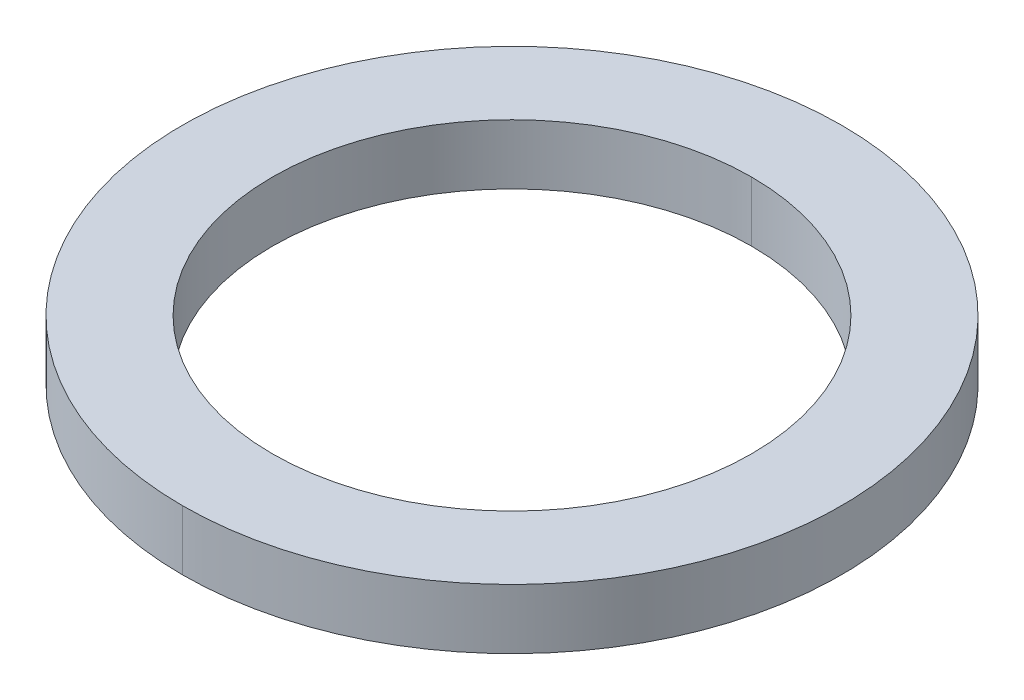
ISO-10303-21;
HEADER;
FILE_DESCRIPTION(('STEP AP214'),'2;1');
FILE_NAME('part.step','',(''),(''),'','','');
FILE_SCHEMA(('AUTOMOTIVE_DESIGN { 1 0 10303 214 1 1 1 1 }'));
ENDSEC;
DATA;
#1=APPLICATION_CONTEXT('core data for automotive mechanical design processes');
#2=APPLICATION_PROTOCOL_DEFINITION('international standard','automotive_design',2000,#1);
#3=PRODUCT_CONTEXT('',#1,'mechanical');
#4=PRODUCT('Part','Part','',(#3));
#5=PRODUCT_RELATED_PRODUCT_CATEGORY('part','',(#4));
#6=PRODUCT_DEFINITION_FORMATION('','',#4);
#7=PRODUCT_DEFINITION_CONTEXT('part definition',#1,'design');
#8=PRODUCT_DEFINITION('design','',#6,#7);
#9=PRODUCT_DEFINITION_SHAPE('','',#8);
#10=(LENGTH_UNIT() NAMED_UNIT(*) SI_UNIT(.MILLI.,.METRE.));
#11=(NAMED_UNIT(*) PLANE_ANGLE_UNIT() SI_UNIT($,.RADIAN.));
#12=(NAMED_UNIT(*) SI_UNIT($,.STERADIAN.) SOLID_ANGLE_UNIT());
#13=UNCERTAINTY_MEASURE_WITH_UNIT(LENGTH_MEASURE(1.E-05),#10,'distance_accuracy_value','');
#14=(GEOMETRIC_REPRESENTATION_CONTEXT(3) GLOBAL_UNCERTAINTY_ASSIGNED_CONTEXT((#13)) GLOBAL_UNIT_ASSIGNED_CONTEXT((#10,
#11,#12)) REPRESENTATION_CONTEXT('',''));
#15=CARTESIAN_POINT('',(0.,0.,0.));
#16=DIRECTION('',(0.,0.,1.));
#17=DIRECTION('',(1.,0.,0.));
#18=AXIS2_PLACEMENT_3D('',#15,#16,#17);
#19=CARTESIAN_POINT('',(0.,1.,0.));
#20=DIRECTION('',(0.,-1.,0.));
#21=DIRECTION('',(0.,0.,-1.));
#22=AXIS2_PLACEMENT_3D('',#19,#20,#21);
#23=CYLINDRICAL_SURFACE('',#22,4.);
#24=DIRECTION('',(0.,-1.,0.));
#25=VECTOR('',#24,1.);
#26=CARTESIAN_POINT('',(0.,1.,4.));
#27=LINE('',#26,#25);
#28=CARTESIAN_POINT('',(0.,1.,4.));
#29=VERTEX_POINT('',#28);
#30=CARTESIAN_POINT('',(0.,0.,4.));
#31=VERTEX_POINT('',#30);
#32=EDGE_CURVE('E99',#29,#31,#27,.T.);
#33=ORIENTED_EDGE('',*,*,#32,.F.);
#34=CARTESIAN_POINT('',(0.,1.,0.));
#35=DIRECTION('',(0.,1.,0.));
#36=DIRECTION('',(0.,0.,1.));
#37=AXIS2_PLACEMENT_3D('',#34,#35,#36);
#38=CIRCLE('',#37,4.);
#39=CARTESIAN_POINT('',(0.,1.,-4.));
#40=VERTEX_POINT('',#39);
#41=EDGE_CURVE('E73',#29,#40,#38,.T.);
#42=ORIENTED_EDGE('',*,*,#41,.T.);
#43=DIRECTION('',(0.,-1.,0.));
#44=VECTOR('',#43,1.);
#45=CARTESIAN_POINT('',(0.,1.,-4.));
#46=LINE('',#45,#44);
#47=CARTESIAN_POINT('',(0.,0.,-4.));
#48=VERTEX_POINT('',#47);
#49=EDGE_CURVE('E85',#40,#48,#46,.T.);
#50=ORIENTED_EDGE('',*,*,#49,.T.);
#51=CARTESIAN_POINT('',(0.,0.,0.));
#52=DIRECTION('',(0.,1.,0.));
#53=DIRECTION('',(0.,0.,1.));
#54=AXIS2_PLACEMENT_3D('',#51,#52,#53);
#55=CIRCLE('',#54,4.);
#56=EDGE_CURVE('E10',#31,#48,#55,.T.);
#57=ORIENTED_EDGE('',*,*,#56,.F.);
#58=EDGE_LOOP('',(#33,#42,#50,#57));
#59=FACE_BOUND('',#58,.T.);
#60=ADVANCED_FACE('F15',(#59),#23,.F.);
#61=CARTESIAN_POINT('',(0.,1.,0.));
#62=DIRECTION('',(0.,-1.,0.));
#63=DIRECTION('',(0.,0.,-1.));
#64=AXIS2_PLACEMENT_3D('',#61,#62,#63);
#65=CYLINDRICAL_SURFACE('',#64,5.5);
#66=DIRECTION('',(0.,-1.,0.));
#67=VECTOR('',#66,1.);
#68=CARTESIAN_POINT('',(0.,1.,5.5));
#69=LINE('',#68,#67);
#70=CARTESIAN_POINT('',(0.,1.,5.5));
#71=VERTEX_POINT('',#70);
#72=CARTESIAN_POINT('',(0.,0.,5.5));
#73=VERTEX_POINT('',#72);
#74=EDGE_CURVE('E76',#71,#73,#69,.T.);
#75=ORIENTED_EDGE('',*,*,#74,.F.);
#76=CARTESIAN_POINT('',(0.,1.,0.));
#77=DIRECTION('',(0.,1.,0.));
#78=DIRECTION('',(0.,0.,1.));
#79=AXIS2_PLACEMENT_3D('',#76,#77,#78);
#80=CIRCLE('',#79,5.5);
#81=CARTESIAN_POINT('',(0.,1.,-5.5));
#82=VERTEX_POINT('',#81);
#83=EDGE_CURVE('E18',#82,#71,#80,.T.);
#84=ORIENTED_EDGE('',*,*,#83,.F.);
#85=DIRECTION('',(0.,-1.,0.));
#86=VECTOR('',#85,1.);
#87=CARTESIAN_POINT('',(0.,1.,-5.5));
#88=LINE('',#87,#86);
#89=CARTESIAN_POINT('',(0.,0.,-5.5));
#90=VERTEX_POINT('',#89);
#91=EDGE_CURVE('E74',#82,#90,#88,.T.);
#92=ORIENTED_EDGE('',*,*,#91,.T.);
#93=CARTESIAN_POINT('',(0.,0.,0.));
#94=DIRECTION('',(0.,1.,0.));
#95=DIRECTION('',(0.,0.,1.));
#96=AXIS2_PLACEMENT_3D('',#93,#94,#95);
#97=CIRCLE('',#96,5.5);
#98=EDGE_CURVE('E25',#90,#73,#97,.T.);
#99=ORIENTED_EDGE('',*,*,#98,.T.);
#100=EDGE_LOOP('',(#75,#84,#92,#99));
#101=FACE_BOUND('',#100,.T.);
#102=ADVANCED_FACE('F77',(#101),#65,.T.);
#103=CARTESIAN_POINT('',(0.,0.,0.));
#104=DIRECTION('',(0.,1.,0.));
#105=DIRECTION('',(1.,0.,0.));
#106=AXIS2_PLACEMENT_3D('',#103,#104,#105);
#107=PLANE('',#106);
#108=CARTESIAN_POINT('',(0.,0.,0.));
#109=DIRECTION('',(0.,1.,0.));
#110=DIRECTION('',(0.,0.,1.));
#111=AXIS2_PLACEMENT_3D('',#108,#109,#110);
#112=CIRCLE('',#111,4.);
#113=EDGE_CURVE('E91',#48,#31,#112,.T.);
#114=ORIENTED_EDGE('',*,*,#113,.T.);
#115=ORIENTED_EDGE('',*,*,#56,.T.);
#116=EDGE_LOOP('',(#114,#115));
#117=FACE_BOUND('',#116,.T.);
#118=ORIENTED_EDGE('',*,*,#98,.F.);
#119=CARTESIAN_POINT('',(0.,0.,0.));
#120=DIRECTION('',(0.,1.,0.));
#121=DIRECTION('',(0.,0.,1.));
#122=AXIS2_PLACEMENT_3D('',#119,#120,#121);
#123=CIRCLE('',#122,5.5);
#124=EDGE_CURVE('E81',#73,#90,#123,.T.);
#125=ORIENTED_EDGE('',*,*,#124,.F.);
#126=EDGE_LOOP('',(#118,#125));
#127=FACE_BOUND('',#126,.T.);
#128=ADVANCED_FACE('F129',(#117,#127),#107,.F.);
#129=CARTESIAN_POINT('',(0.,1.,0.));
#130=DIRECTION('',(0.,1.,0.));
#131=DIRECTION('',(1.,0.,0.));
#132=AXIS2_PLACEMENT_3D('',#129,#130,#131);
#133=PLANE('',#132);
#134=CARTESIAN_POINT('',(0.,1.,0.));
#135=DIRECTION('',(0.,1.,0.));
#136=DIRECTION('',(0.,0.,1.));
#137=AXIS2_PLACEMENT_3D('',#134,#135,#136);
#138=CIRCLE('',#137,4.);
#139=EDGE_CURVE('E95',#40,#29,#138,.T.);
#140=ORIENTED_EDGE('',*,*,#139,.F.);
#141=ORIENTED_EDGE('',*,*,#41,.F.);
#142=EDGE_LOOP('',(#140,#141));
#143=FACE_BOUND('',#142,.T.);
#144=ORIENTED_EDGE('',*,*,#83,.T.);
#145=CARTESIAN_POINT('',(0.,1.,0.));
#146=DIRECTION('',(0.,1.,0.));
#147=DIRECTION('',(0.,0.,1.));
#148=AXIS2_PLACEMENT_3D('',#145,#146,#147);
#149=CIRCLE('',#148,5.5);
#150=EDGE_CURVE('E71',#71,#82,#149,.T.);
#151=ORIENTED_EDGE('',*,*,#150,.T.);
#152=EDGE_LOOP('',(#144,#151));
#153=FACE_BOUND('',#152,.T.);
#154=ADVANCED_FACE('F69',(#143,#153),#133,.T.);
#155=CARTESIAN_POINT('',(0.,1.,0.));
#156=DIRECTION('',(0.,-1.,0.));
#157=DIRECTION('',(0.,0.,-1.));
#158=AXIS2_PLACEMENT_3D('',#155,#156,#157);
#159=CYLINDRICAL_SURFACE('',#158,5.5);
#160=ORIENTED_EDGE('',*,*,#150,.F.);
#161=ORIENTED_EDGE('',*,*,#74,.T.);
#162=ORIENTED_EDGE('',*,*,#124,.T.);
#163=ORIENTED_EDGE('',*,*,#91,.F.);
#164=EDGE_LOOP('',(#160,#161,#162,#163));
#165=FACE_BOUND('',#164,.T.);
#166=ADVANCED_FACE('F83',(#165),#159,.T.);
#167=CARTESIAN_POINT('',(0.,1.,0.));
#168=DIRECTION('',(0.,-1.,0.));
#169=DIRECTION('',(0.,0.,-1.));
#170=AXIS2_PLACEMENT_3D('',#167,#168,#169);
#171=CYLINDRICAL_SURFACE('',#170,4.);
#172=ORIENTED_EDGE('',*,*,#139,.T.);
#173=ORIENTED_EDGE('',*,*,#32,.T.);
#174=ORIENTED_EDGE('',*,*,#113,.F.);
#175=ORIENTED_EDGE('',*,*,#49,.F.);
#176=EDGE_LOOP('',(#172,#173,#174,#175));
#177=FACE_BOUND('',#176,.T.);
#178=ADVANCED_FACE('F120',(#177),#171,.F.);
#179=CLOSED_SHELL('',(#60,#102,#128,#154,#166,#178));
#180=MANIFOLD_SOLID_BREP('B1',#179);
#181=ADVANCED_BREP_SHAPE_REPRESENTATION('',(#18,#180),#14);
#182=SHAPE_DEFINITION_REPRESENTATION(#9,#181);
ENDSEC;
END-ISO-10303-21;
